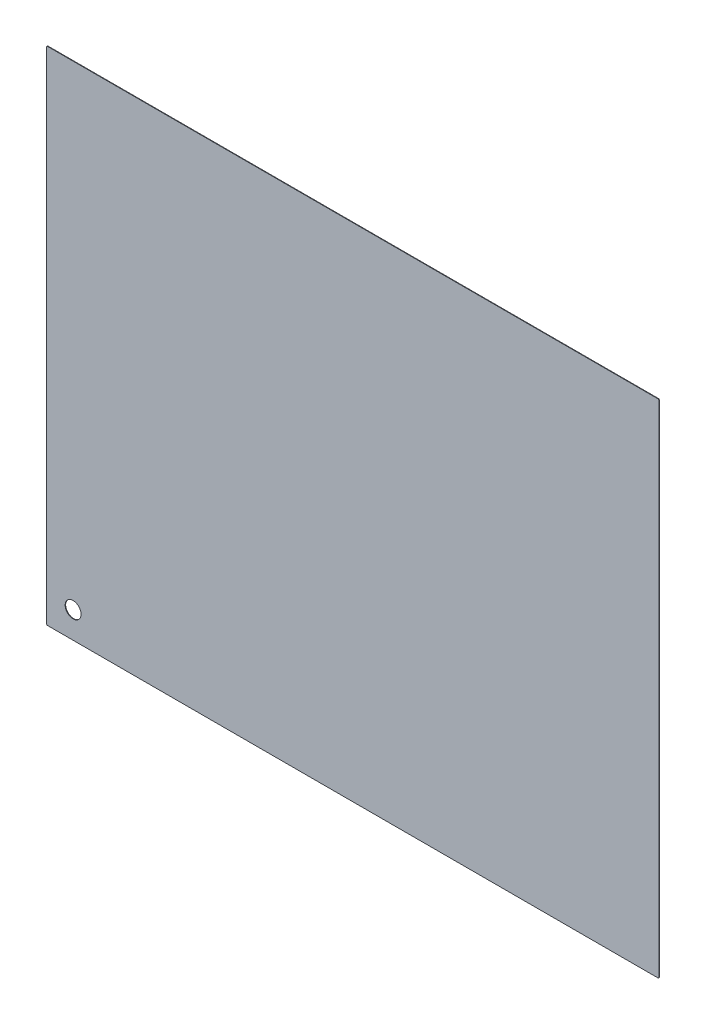
ISO-10303-21;
HEADER;
FILE_DESCRIPTION(('STEP AP214'),'2;1');
FILE_NAME('part.step','',(''),(''),'','','');
FILE_SCHEMA(('AUTOMOTIVE_DESIGN { 1 0 10303 214 1 1 1 1 }'));
ENDSEC;
DATA;
#1=APPLICATION_CONTEXT('core data for automotive mechanical design processes');
#2=APPLICATION_PROTOCOL_DEFINITION('international standard','automotive_design',2000,#1);
#3=PRODUCT_CONTEXT('',#1,'mechanical');
#4=PRODUCT('Part','Part','',(#3));
#5=PRODUCT_RELATED_PRODUCT_CATEGORY('part','',(#4));
#6=PRODUCT_DEFINITION_FORMATION('','',#4);
#7=PRODUCT_DEFINITION_CONTEXT('part definition',#1,'design');
#8=PRODUCT_DEFINITION('design','',#6,#7);
#9=PRODUCT_DEFINITION_SHAPE('','',#8);
#10=(LENGTH_UNIT() NAMED_UNIT(*) SI_UNIT(.MILLI.,.METRE.));
#11=(NAMED_UNIT(*) PLANE_ANGLE_UNIT() SI_UNIT($,.RADIAN.));
#12=(NAMED_UNIT(*) SI_UNIT($,.STERADIAN.) SOLID_ANGLE_UNIT());
#13=UNCERTAINTY_MEASURE_WITH_UNIT(LENGTH_MEASURE(1.E-05),#10,'distance_accuracy_value','');
#14=(GEOMETRIC_REPRESENTATION_CONTEXT(3) GLOBAL_UNCERTAINTY_ASSIGNED_CONTEXT((#13)) GLOBAL_UNIT_ASSIGNED_CONTEXT((#10,
#11,#12)) REPRESENTATION_CONTEXT('',''));
#15=CARTESIAN_POINT('',(0.,0.,0.));
#16=DIRECTION('',(0.,0.,1.));
#17=DIRECTION('',(1.,0.,0.));
#18=AXIS2_PLACEMENT_3D('',#15,#16,#17);
#19=CARTESIAN_POINT('',(2.,2.,-1.));
#20=DIRECTION('',(0.,0.,1.));
#21=DIRECTION('',(1.,0.,0.));
#22=AXIS2_PLACEMENT_3D('',#19,#20,#21);
#23=CYLINDRICAL_SURFACE('',#22,2.);
#24=CARTESIAN_POINT('',(2.,2.,0.));
#25=DIRECTION('',(0.,0.,1.));
#26=DIRECTION('',(-1.,0.,0.));
#27=AXIS2_PLACEMENT_3D('',#24,#25,#26);
#28=CIRCLE('',#27,2.);
#29=CARTESIAN_POINT('',(0.,2.00000000000001,0.));
#30=VERTEX_POINT('',#29);
#31=CARTESIAN_POINT('',(2.00000000000001,0.,0.));
#32=VERTEX_POINT('',#31);
#33=EDGE_CURVE('E138',#30,#32,#28,.T.);
#34=ORIENTED_EDGE('',*,*,#33,.F.);
#35=DIRECTION('',(0.,0.,1.));
#36=VECTOR('',#35,1.);
#37=CARTESIAN_POINT('',(0.,2.00000000000001,-1.));
#38=LINE('',#37,#36);
#39=CARTESIAN_POINT('',(0.,2.00000000000001,-1.));
#40=VERTEX_POINT('',#39);
#41=EDGE_CURVE('E11',#40,#30,#38,.T.);
#42=ORIENTED_EDGE('',*,*,#41,.F.);
#43=CARTESIAN_POINT('',(2.,2.,-1.));
#44=DIRECTION('',(0.,0.,1.));
#45=DIRECTION('',(-1.,0.,0.));
#46=AXIS2_PLACEMENT_3D('',#43,#44,#45);
#47=CIRCLE('',#46,2.);
#48=CARTESIAN_POINT('',(2.00000000000001,0.,-1.));
#49=VERTEX_POINT('',#48);
#50=EDGE_CURVE('E159',#40,#49,#47,.T.);
#51=ORIENTED_EDGE('',*,*,#50,.T.);
#52=DIRECTION('',(0.,0.,1.));
#53=VECTOR('',#52,1.);
#54=CARTESIAN_POINT('',(2.00000000000001,0.,-1.));
#55=LINE('',#54,#53);
#56=EDGE_CURVE('E44',#49,#32,#55,.T.);
#57=ORIENTED_EDGE('',*,*,#56,.T.);
#58=EDGE_LOOP('',(#34,#42,#51,#57));
#59=FACE_BOUND('',#58,.T.);
#60=ADVANCED_FACE('F41',(#59),#23,.T.);
#61=CARTESIAN_POINT('',(0.,2.00000000000001,-1.));
#62=DIRECTION('',(-1.,0.,0.));
#63=DIRECTION('',(0.,0.,1.));
#64=AXIS2_PLACEMENT_3D('',#61,#62,#63);
#65=PLANE('',#64);
#66=DIRECTION('',(0.,-1.,0.));
#67=VECTOR('',#66,1.);
#68=CARTESIAN_POINT('',(0.,2.00000000000001,0.));
#69=LINE('',#68,#67);
#70=CARTESIAN_POINT('',(0.,945.,0.));
#71=VERTEX_POINT('',#70);
#72=EDGE_CURVE('E157',#71,#30,#69,.T.);
#73=ORIENTED_EDGE('',*,*,#72,.F.);
#74=DIRECTION('',(0.,0.,1.));
#75=VECTOR('',#74,1.);
#76=CARTESIAN_POINT('',(0.,945.,-1.));
#77=LINE('',#76,#75);
#78=CARTESIAN_POINT('',(0.,945.,-1.));
#79=VERTEX_POINT('',#78);
#80=EDGE_CURVE('E50',#79,#71,#77,.T.);
#81=ORIENTED_EDGE('',*,*,#80,.F.);
#82=DIRECTION('',(0.,-1.,0.));
#83=VECTOR('',#82,1.);
#84=CARTESIAN_POINT('',(0.,2.00000000000001,-1.));
#85=LINE('',#84,#83);
#86=EDGE_CURVE('E128',#79,#40,#85,.T.);
#87=ORIENTED_EDGE('',*,*,#86,.T.);
#88=ORIENTED_EDGE('',*,*,#41,.T.);
#89=EDGE_LOOP('',(#73,#81,#87,#88));
#90=FACE_BOUND('',#89,.T.);
#91=ADVANCED_FACE('F171',(#90),#65,.T.);
#92=CARTESIAN_POINT('',(2.,945.,-1.));
#93=DIRECTION('',(0.,0.,1.));
#94=DIRECTION('',(1.,0.,0.));
#95=AXIS2_PLACEMENT_3D('',#92,#93,#94);
#96=CYLINDRICAL_SURFACE('',#95,2.);
#97=CARTESIAN_POINT('',(2.,945.,0.));
#98=DIRECTION('',(0.,0.,1.));
#99=DIRECTION('',(-1.,0.,0.));
#100=AXIS2_PLACEMENT_3D('',#97,#98,#99);
#101=CIRCLE('',#100,2.);
#102=CARTESIAN_POINT('',(2.,947.,0.));
#103=VERTEX_POINT('',#102);
#104=EDGE_CURVE('E115',#103,#71,#101,.T.);
#105=ORIENTED_EDGE('',*,*,#104,.F.);
#106=DIRECTION('',(0.,0.,1.));
#107=VECTOR('',#106,1.);
#108=CARTESIAN_POINT('',(2.,947.,-1.));
#109=LINE('',#108,#107);
#110=CARTESIAN_POINT('',(2.,947.,-1.));
#111=VERTEX_POINT('',#110);
#112=EDGE_CURVE('E110',#111,#103,#109,.T.);
#113=ORIENTED_EDGE('',*,*,#112,.F.);
#114=CARTESIAN_POINT('',(2.,945.,-1.));
#115=DIRECTION('',(0.,0.,1.));
#116=DIRECTION('',(-1.,0.,0.));
#117=AXIS2_PLACEMENT_3D('',#114,#115,#116);
#118=CIRCLE('',#117,2.);
#119=EDGE_CURVE('E113',#111,#79,#118,.T.);
#120=ORIENTED_EDGE('',*,*,#119,.T.);
#121=ORIENTED_EDGE('',*,*,#80,.T.);
#122=EDGE_LOOP('',(#105,#113,#120,#121));
#123=FACE_BOUND('',#122,.T.);
#124=ADVANCED_FACE('F112',(#123),#96,.T.);
#125=CARTESIAN_POINT('',(2.,947.,-1.));
#126=DIRECTION('',(0.,1.,0.));
#127=DIRECTION('',(0.,0.,1.));
#128=AXIS2_PLACEMENT_3D('',#125,#126,#127);
#129=PLANE('',#128);
#130=DIRECTION('',(-1.,0.,0.));
#131=VECTOR('',#130,1.);
#132=CARTESIAN_POINT('',(2.,947.,0.));
#133=LINE('',#132,#131);
#134=CARTESIAN_POINT('',(1154.,947.,0.));
#135=VERTEX_POINT('',#134);
#136=EDGE_CURVE('E154',#135,#103,#133,.T.);
#137=ORIENTED_EDGE('',*,*,#136,.F.);
#138=DIRECTION('',(0.,0.,1.));
#139=VECTOR('',#138,1.);
#140=CARTESIAN_POINT('',(1154.,947.,-1.));
#141=LINE('',#140,#139);
#142=CARTESIAN_POINT('',(1154.,947.,-1.));
#143=VERTEX_POINT('',#142);
#144=EDGE_CURVE('E120',#143,#135,#141,.T.);
#145=ORIENTED_EDGE('',*,*,#144,.F.);
#146=DIRECTION('',(-1.,0.,0.));
#147=VECTOR('',#146,1.);
#148=CARTESIAN_POINT('',(2.,947.,-1.));
#149=LINE('',#148,#147);
#150=EDGE_CURVE('E126',#143,#111,#149,.T.);
#151=ORIENTED_EDGE('',*,*,#150,.T.);
#152=ORIENTED_EDGE('',*,*,#112,.T.);
#153=EDGE_LOOP('',(#137,#145,#151,#152));
#154=FACE_BOUND('',#153,.T.);
#155=ADVANCED_FACE('F130',(#154),#129,.T.);
#156=CARTESIAN_POINT('',(1154.,945.,-1.));
#157=DIRECTION('',(0.,0.,1.));
#158=DIRECTION('',(1.,0.,0.));
#159=AXIS2_PLACEMENT_3D('',#156,#157,#158);
#160=CYLINDRICAL_SURFACE('',#159,2.);
#161=CARTESIAN_POINT('',(1154.,945.,0.));
#162=DIRECTION('',(0.,0.,1.));
#163=DIRECTION('',(-1.,0.,0.));
#164=AXIS2_PLACEMENT_3D('',#161,#162,#163);
#165=CIRCLE('',#164,2.);
#166=CARTESIAN_POINT('',(1156.,945.,0.));
#167=VERTEX_POINT('',#166);
#168=EDGE_CURVE('E151',#167,#135,#165,.T.);
#169=ORIENTED_EDGE('',*,*,#168,.F.);
#170=DIRECTION('',(0.,0.,1.));
#171=VECTOR('',#170,1.);
#172=CARTESIAN_POINT('',(1156.,945.,-1.));
#173=LINE('',#172,#171);
#174=CARTESIAN_POINT('',(1156.,945.,-1.));
#175=VERTEX_POINT('',#174);
#176=EDGE_CURVE('E163',#175,#167,#173,.T.);
#177=ORIENTED_EDGE('',*,*,#176,.F.);
#178=CARTESIAN_POINT('',(1154.,945.,-1.));
#179=DIRECTION('',(0.,0.,1.));
#180=DIRECTION('',(-1.,0.,0.));
#181=AXIS2_PLACEMENT_3D('',#178,#179,#180);
#182=CIRCLE('',#181,2.);
#183=EDGE_CURVE('E131',#175,#143,#182,.T.);
#184=ORIENTED_EDGE('',*,*,#183,.T.);
#185=ORIENTED_EDGE('',*,*,#144,.T.);
#186=EDGE_LOOP('',(#169,#177,#184,#185));
#187=FACE_BOUND('',#186,.T.);
#188=ADVANCED_FACE('F184',(#187),#160,.T.);
#189=CARTESIAN_POINT('',(1156.,2.,-1.));
#190=DIRECTION('',(1.,0.,0.));
#191=DIRECTION('',(0.,0.,-1.));
#192=AXIS2_PLACEMENT_3D('',#189,#190,#191);
#193=PLANE('',#192);
#194=DIRECTION('',(0.,1.,0.));
#195=VECTOR('',#194,1.);
#196=CARTESIAN_POINT('',(1156.,2.,0.));
#197=LINE('',#196,#195);
#198=CARTESIAN_POINT('',(1156.,2.,0.));
#199=VERTEX_POINT('',#198);
#200=EDGE_CURVE('E148',#199,#167,#197,.T.);
#201=ORIENTED_EDGE('',*,*,#200,.F.);
#202=DIRECTION('',(0.,0.,1.));
#203=VECTOR('',#202,1.);
#204=CARTESIAN_POINT('',(1156.,2.,-1.));
#205=LINE('',#204,#203);
#206=CARTESIAN_POINT('',(1156.,2.,-1.));
#207=VERTEX_POINT('',#206);
#208=EDGE_CURVE('E165',#207,#199,#205,.T.);
#209=ORIENTED_EDGE('',*,*,#208,.F.);
#210=DIRECTION('',(0.,1.,0.));
#211=VECTOR('',#210,1.);
#212=CARTESIAN_POINT('',(1156.,2.,-1.));
#213=LINE('',#212,#211);
#214=EDGE_CURVE('E133',#207,#175,#213,.T.);
#215=ORIENTED_EDGE('',*,*,#214,.T.);
#216=ORIENTED_EDGE('',*,*,#176,.T.);
#217=EDGE_LOOP('',(#201,#209,#215,#216));
#218=FACE_BOUND('',#217,.T.);
#219=ADVANCED_FACE('F187',(#218),#193,.T.);
#220=CARTESIAN_POINT('',(1154.,2.,-1.));
#221=DIRECTION('',(0.,0.,1.));
#222=DIRECTION('',(1.,0.,0.));
#223=AXIS2_PLACEMENT_3D('',#220,#221,#222);
#224=CYLINDRICAL_SURFACE('',#223,2.);
#225=CARTESIAN_POINT('',(1154.,2.,0.));
#226=DIRECTION('',(0.,0.,1.));
#227=DIRECTION('',(1.,0.,0.));
#228=AXIS2_PLACEMENT_3D('',#225,#226,#227);
#229=CIRCLE('',#228,2.);
#230=CARTESIAN_POINT('',(1154.,0.,0.));
#231=VERTEX_POINT('',#230);
#232=EDGE_CURVE('E145',#231,#199,#229,.T.);
#233=ORIENTED_EDGE('',*,*,#232,.F.);
#234=DIRECTION('',(0.,0.,1.));
#235=VECTOR('',#234,1.);
#236=CARTESIAN_POINT('',(1154.,0.,-1.));
#237=LINE('',#236,#235);
#238=CARTESIAN_POINT('',(1154.,0.,-1.));
#239=VERTEX_POINT('',#238);
#240=EDGE_CURVE('E166',#239,#231,#237,.T.);
#241=ORIENTED_EDGE('',*,*,#240,.F.);
#242=CARTESIAN_POINT('',(1154.,2.,-1.));
#243=DIRECTION('',(0.,0.,1.));
#244=DIRECTION('',(1.,0.,0.));
#245=AXIS2_PLACEMENT_3D('',#242,#243,#244);
#246=CIRCLE('',#245,2.);
#247=EDGE_CURVE('E222',#239,#207,#246,.T.);
#248=ORIENTED_EDGE('',*,*,#247,.T.);
#249=ORIENTED_EDGE('',*,*,#208,.T.);
#250=EDGE_LOOP('',(#233,#241,#248,#249));
#251=FACE_BOUND('',#250,.T.);
#252=ADVANCED_FACE('F191',(#251),#224,.T.);
#253=CARTESIAN_POINT('',(2.00000000000001,0.,-1.));
#254=DIRECTION('',(0.,-1.,0.));
#255=DIRECTION('',(0.,0.,-1.));
#256=AXIS2_PLACEMENT_3D('',#253,#254,#255);
#257=PLANE('',#256);
#258=DIRECTION('',(1.,0.,0.));
#259=VECTOR('',#258,1.);
#260=CARTESIAN_POINT('',(2.00000000000001,0.,0.));
#261=LINE('',#260,#259);
#262=EDGE_CURVE('E141',#32,#231,#261,.T.);
#263=ORIENTED_EDGE('',*,*,#262,.F.);
#264=ORIENTED_EDGE('',*,*,#56,.F.);
#265=DIRECTION('',(1.,0.,0.));
#266=VECTOR('',#265,1.);
#267=CARTESIAN_POINT('',(2.00000000000001,0.,-1.));
#268=LINE('',#267,#266);
#269=EDGE_CURVE('E220',#49,#239,#268,.T.);
#270=ORIENTED_EDGE('',*,*,#269,.T.);
#271=ORIENTED_EDGE('',*,*,#240,.T.);
#272=EDGE_LOOP('',(#263,#264,#270,#271));
#273=FACE_BOUND('',#272,.T.);
#274=ADVANCED_FACE('F168',(#273),#257,.T.);
#275=CARTESIAN_POINT('',(2.,2.,-1.));
#276=DIRECTION('',(0.,0.,-1.));
#277=DIRECTION('',(-1.,0.,0.));
#278=AXIS2_PLACEMENT_3D('',#275,#276,#277);
#279=PLANE('',#278);
#280=CARTESIAN_POINT('',(50.,50.,-1.));
#281=DIRECTION('',(0.,0.,1.));
#282=DIRECTION('',(1.,0.,0.));
#283=AXIS2_PLACEMENT_3D('',#280,#281,#282);
#284=CIRCLE('',#283,15.);
#285=CARTESIAN_POINT('',(65.,50.,-1.));
#286=VERTEX_POINT('',#285);
#287=EDGE_CURVE('E142',#286,#286,#284,.T.);
#288=ORIENTED_EDGE('',*,*,#287,.T.);
#289=EDGE_LOOP('',(#288));
#290=FACE_BOUND('',#289,.T.);
#291=ORIENTED_EDGE('',*,*,#50,.F.);
#292=ORIENTED_EDGE('',*,*,#86,.F.);
#293=ORIENTED_EDGE('',*,*,#119,.F.);
#294=ORIENTED_EDGE('',*,*,#150,.F.);
#295=ORIENTED_EDGE('',*,*,#183,.F.);
#296=ORIENTED_EDGE('',*,*,#214,.F.);
#297=ORIENTED_EDGE('',*,*,#247,.F.);
#298=ORIENTED_EDGE('',*,*,#269,.F.);
#299=EDGE_LOOP('',(#291,#292,#293,#294,#295,#296,#297,#298));
#300=FACE_BOUND('',#299,.T.);
#301=ADVANCED_FACE('F124',(#290,#300),#279,.T.);
#302=CARTESIAN_POINT('',(2.,2.,0.));
#303=DIRECTION('',(0.,0.,-1.));
#304=DIRECTION('',(-1.,0.,0.));
#305=AXIS2_PLACEMENT_3D('',#302,#303,#304);
#306=PLANE('',#305);
#307=CARTESIAN_POINT('',(50.,50.,0.));
#308=DIRECTION('',(0.,0.,1.));
#309=DIRECTION('',(1.,0.,0.));
#310=AXIS2_PLACEMENT_3D('',#307,#308,#309);
#311=CIRCLE('',#310,15.);
#312=CARTESIAN_POINT('',(65.,50.,0.));
#313=VERTEX_POINT('',#312);
#314=EDGE_CURVE('E215',#313,#313,#311,.T.);
#315=ORIENTED_EDGE('',*,*,#314,.F.);
#316=EDGE_LOOP('',(#315));
#317=FACE_BOUND('',#316,.T.);
#318=ORIENTED_EDGE('',*,*,#33,.T.);
#319=ORIENTED_EDGE('',*,*,#262,.T.);
#320=ORIENTED_EDGE('',*,*,#232,.T.);
#321=ORIENTED_EDGE('',*,*,#200,.T.);
#322=ORIENTED_EDGE('',*,*,#168,.T.);
#323=ORIENTED_EDGE('',*,*,#136,.T.);
#324=ORIENTED_EDGE('',*,*,#104,.T.);
#325=ORIENTED_EDGE('',*,*,#72,.T.);
#326=EDGE_LOOP('',(#318,#319,#320,#321,#322,#323,#324,#325));
#327=FACE_BOUND('',#326,.T.);
#328=ADVANCED_FACE('F170',(#317,#327),#306,.F.);
#329=CARTESIAN_POINT('',(50.,50.,-1.));
#330=DIRECTION('',(0.,0.,1.));
#331=DIRECTION('',(1.,0.,0.));
#332=AXIS2_PLACEMENT_3D('',#329,#330,#331);
#333=CYLINDRICAL_SURFACE('',#332,15.);
#334=ORIENTED_EDGE('',*,*,#287,.F.);
#335=EDGE_LOOP('',(#334));
#336=FACE_BOUND('',#335,.T.);
#337=ORIENTED_EDGE('',*,*,#314,.T.);
#338=EDGE_LOOP('',(#337));
#339=FACE_BOUND('',#338,.T.);
#340=ADVANCED_FACE('F203',(#336,#339),#333,.F.);
#341=CLOSED_SHELL('',(#60,#91,#124,#155,#188,#219,#252,#274,#301,#328,#340));
#342=MANIFOLD_SOLID_BREP('B2',#341);
#343=ADVANCED_BREP_SHAPE_REPRESENTATION('',(#18,#342),#14);
#344=SHAPE_DEFINITION_REPRESENTATION(#9,#343);
ENDSEC;
END-ISO-10303-21;
